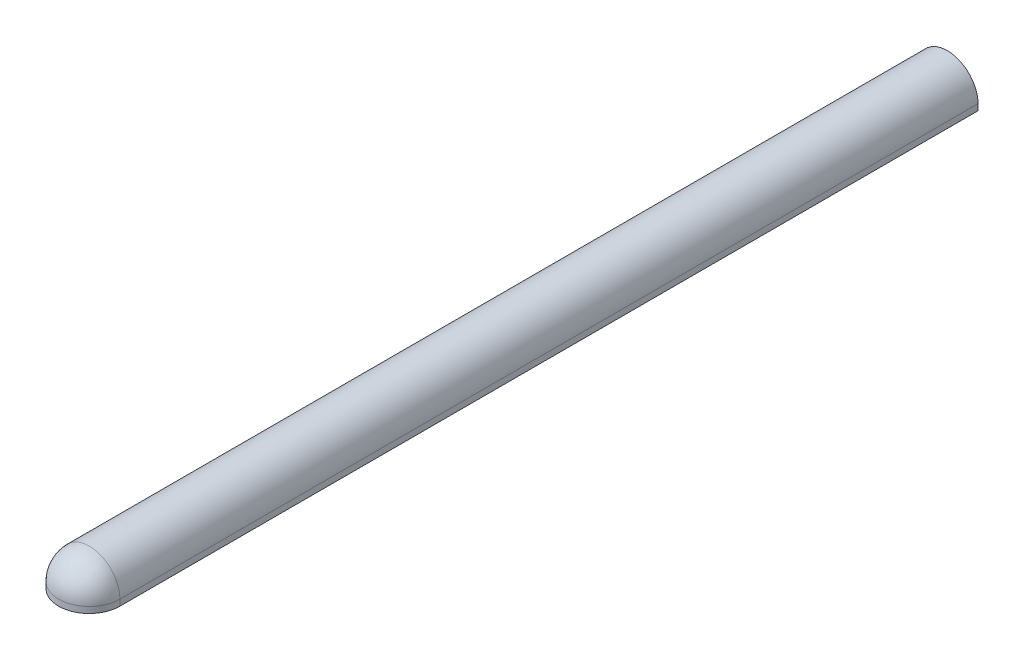
ISO-10303-21;
HEADER;
FILE_DESCRIPTION(('STEP AP214'),'2;1');
FILE_NAME('part.step','',(''),(''),'','','');
FILE_SCHEMA(('AUTOMOTIVE_DESIGN { 1 0 10303 214 1 1 1 1 }'));
ENDSEC;
DATA;
#1=APPLICATION_CONTEXT('core data for automotive mechanical design processes');
#2=APPLICATION_PROTOCOL_DEFINITION('international standard','automotive_design',2000,#1);
#3=PRODUCT_CONTEXT('',#1,'mechanical');
#4=PRODUCT('Part','Part','',(#3));
#5=PRODUCT_RELATED_PRODUCT_CATEGORY('part','',(#4));
#6=PRODUCT_DEFINITION_FORMATION('','',#4);
#7=PRODUCT_DEFINITION_CONTEXT('part definition',#1,'design');
#8=PRODUCT_DEFINITION('design','',#6,#7);
#9=PRODUCT_DEFINITION_SHAPE('','',#8);
#10=(LENGTH_UNIT() NAMED_UNIT(*) SI_UNIT(.MILLI.,.METRE.));
#11=(NAMED_UNIT(*) PLANE_ANGLE_UNIT() SI_UNIT($,.RADIAN.));
#12=(NAMED_UNIT(*) SI_UNIT($,.STERADIAN.) SOLID_ANGLE_UNIT());
#13=UNCERTAINTY_MEASURE_WITH_UNIT(LENGTH_MEASURE(1.E-05),#10,'distance_accuracy_value','');
#14=(GEOMETRIC_REPRESENTATION_CONTEXT(3) GLOBAL_UNCERTAINTY_ASSIGNED_CONTEXT((#13)) GLOBAL_UNIT_ASSIGNED_CONTEXT((#10,
#11,#12)) REPRESENTATION_CONTEXT('',''));
#15=CARTESIAN_POINT('',(0.,0.,0.));
#16=DIRECTION('',(0.,0.,1.));
#17=DIRECTION('',(1.,0.,0.));
#18=AXIS2_PLACEMENT_3D('',#15,#16,#17);
#19=CARTESIAN_POINT('',(0.,0.127000000000003,0.));
#20=DIRECTION('',(1.,0.,0.));
#21=DIRECTION('',(0.,-1.,0.));
#22=AXIS2_PLACEMENT_3D('',#19,#20,#21);
#23=SPHERICAL_SURFACE('',#22,0.4064);
#24=CARTESIAN_POINT('',(0.,0.127000000000003,0.));
#25=DIRECTION('',(0.,0.,-1.));
#26=DIRECTION('',(-1.,0.,0.));
#27=AXIS2_PLACEMENT_3D('',#24,#25,#26);
#28=CIRCLE('',#27,0.4064);
#29=CARTESIAN_POINT('',(-0.4064,0.127000000000003,0.));
#30=VERTEX_POINT('',#29);
#31=CARTESIAN_POINT('',(0.4064,0.127000000000003,0.));
#32=VERTEX_POINT('',#31);
#33=EDGE_CURVE('E103',#30,#32,#28,.T.);
#34=ORIENTED_EDGE('',*,*,#33,.T.);
#35=CARTESIAN_POINT('',(0.,0.127000000000003,0.));
#36=DIRECTION('',(0.,1.,0.));
#37=DIRECTION('',(0.,0.,1.));
#38=AXIS2_PLACEMENT_3D('',#35,#36,#37);
#39=CIRCLE('',#38,0.4064);
#40=EDGE_CURVE('E102',#32,#30,#39,.F.);
#41=ORIENTED_EDGE('',*,*,#40,.T.);
#42=EDGE_LOOP('',(#34,#41));
#43=FACE_BOUND('',#42,.T.);
#44=ADVANCED_FACE('F17',(#43),#23,.F.);
#45=CARTESIAN_POINT('',(0.,0.127000000000003,0.));
#46=DIRECTION('',(0.,0.,-1.));
#47=DIRECTION('',(-1.,0.,0.));
#48=AXIS2_PLACEMENT_3D('',#45,#46,#47);
#49=CYLINDRICAL_SURFACE('',#48,0.4064);
#50=DIRECTION('',(0.,0.,1.));
#51=VECTOR('',#50,1.);
#52=CARTESIAN_POINT('',(0.4064,0.127000000000003,0.));
#53=LINE('',#52,#51);
#54=CARTESIAN_POINT('',(0.4064,0.127000000000003,-17.78));
#55=VERTEX_POINT('',#54);
#56=EDGE_CURVE('E97',#32,#55,#53,.F.);
#57=ORIENTED_EDGE('',*,*,#56,.F.);
#58=ORIENTED_EDGE('',*,*,#33,.F.);
#59=DIRECTION('',(0.,0.,-1.));
#60=VECTOR('',#59,1.);
#61=CARTESIAN_POINT('',(-0.4064,0.127000000000003,0.));
#62=LINE('',#61,#60);
#63=CARTESIAN_POINT('',(-0.4064,0.127000000000003,-17.78));
#64=VERTEX_POINT('',#63);
#65=EDGE_CURVE('E100',#64,#30,#62,.F.);
#66=ORIENTED_EDGE('',*,*,#65,.F.);
#67=CARTESIAN_POINT('',(0.,0.127000000000003,-17.78));
#68=DIRECTION('',(0.,0.,-1.));
#69=DIRECTION('',(-1.,0.,0.));
#70=AXIS2_PLACEMENT_3D('',#67,#68,#69);
#71=CIRCLE('',#70,0.4064);
#72=EDGE_CURVE('E21',#55,#64,#71,.F.);
#73=ORIENTED_EDGE('',*,*,#72,.F.);
#74=EDGE_LOOP('',(#57,#58,#66,#73));
#75=FACE_BOUND('',#74,.T.);
#76=ADVANCED_FACE('F95',(#75),#49,.F.);
#77=CARTESIAN_POINT('',(0.,0.800100000000003,0.));
#78=DIRECTION('',(0.,1.,0.));
#79=DIRECTION('',(0.,0.,1.));
#80=AXIS2_PLACEMENT_3D('',#77,#78,#79);
#81=CYLINDRICAL_SURFACE('',#80,0.4064);
#82=CARTESIAN_POINT('',(0.,0.,0.));
#83=DIRECTION('',(0.,1.,0.));
#84=DIRECTION('',(0.,0.,1.));
#85=AXIS2_PLACEMENT_3D('',#82,#83,#84);
#86=CIRCLE('',#85,0.4064);
#87=CARTESIAN_POINT('',(0.4064,0.,0.));
#88=VERTEX_POINT('',#87);
#89=CARTESIAN_POINT('',(-0.4064,0.,0.));
#90=VERTEX_POINT('',#89);
#91=EDGE_CURVE('E106',#88,#90,#86,.F.);
#92=ORIENTED_EDGE('',*,*,#91,.T.);
#93=DIRECTION('',(0.,1.,0.));
#94=VECTOR('',#93,1.);
#95=CARTESIAN_POINT('',(-0.4064,0.127000000000003,0.));
#96=LINE('',#95,#94);
#97=EDGE_CURVE('E91',#30,#90,#96,.F.);
#98=ORIENTED_EDGE('',*,*,#97,.F.);
#99=ORIENTED_EDGE('',*,*,#40,.F.);
#100=DIRECTION('',(0.,1.,0.));
#101=VECTOR('',#100,1.);
#102=CARTESIAN_POINT('',(0.4064,0.127000000000003,0.));
#103=LINE('',#102,#101);
#104=EDGE_CURVE('E90',#88,#32,#103,.T.);
#105=ORIENTED_EDGE('',*,*,#104,.F.);
#106=EDGE_LOOP('',(#92,#98,#99,#105));
#107=FACE_BOUND('',#106,.T.);
#108=ADVANCED_FACE('F292',(#107),#81,.F.);
#109=CARTESIAN_POINT('',(-0.4064,0.127000000000003,0.));
#110=DIRECTION('',(1.,0.,0.));
#111=DIRECTION('',(0.,0.,-1.));
#112=AXIS2_PLACEMENT_3D('',#109,#110,#111);
#113=PLANE('',#112);
#114=ORIENTED_EDGE('',*,*,#97,.T.);
#115=DIRECTION('',(0.,0.,1.));
#116=VECTOR('',#115,1.);
#117=CARTESIAN_POINT('',(-0.4064,0.,0.));
#118=LINE('',#117,#116);
#119=CARTESIAN_POINT('',(-0.4064,0.,-17.78));
#120=VERTEX_POINT('',#119);
#121=EDGE_CURVE('E108',#90,#120,#118,.F.);
#122=ORIENTED_EDGE('',*,*,#121,.T.);
#123=DIRECTION('',(0.,1.,0.));
#124=VECTOR('',#123,1.);
#125=CARTESIAN_POINT('',(-0.4064,0.127000000000003,-17.78));
#126=LINE('',#125,#124);
#127=EDGE_CURVE('E121',#120,#64,#126,.T.);
#128=ORIENTED_EDGE('',*,*,#127,.T.);
#129=ORIENTED_EDGE('',*,*,#65,.T.);
#130=EDGE_LOOP('',(#114,#122,#128,#129));
#131=FACE_BOUND('',#130,.T.);
#132=ADVANCED_FACE('F179',(#131),#113,.T.);
#133=CARTESIAN_POINT('',(0.4064,0.127000000000003,0.));
#134=DIRECTION('',(-1.,0.,0.));
#135=DIRECTION('',(0.,0.,1.));
#136=AXIS2_PLACEMENT_3D('',#133,#134,#135);
#137=PLANE('',#136);
#138=ORIENTED_EDGE('',*,*,#104,.T.);
#139=ORIENTED_EDGE('',*,*,#56,.T.);
#140=DIRECTION('',(0.,1.,0.));
#141=VECTOR('',#140,1.);
#142=CARTESIAN_POINT('',(0.4064,0.127000000000003,-17.78));
#143=LINE('',#142,#141);
#144=CARTESIAN_POINT('',(0.4064,0.,-17.78));
#145=VERTEX_POINT('',#144);
#146=EDGE_CURVE('E80',#55,#145,#143,.F.);
#147=ORIENTED_EDGE('',*,*,#146,.T.);
#148=DIRECTION('',(0.,0.,1.));
#149=VECTOR('',#148,1.);
#150=CARTESIAN_POINT('',(0.4064,0.,0.));
#151=LINE('',#150,#149);
#152=EDGE_CURVE('E135',#145,#88,#151,.T.);
#153=ORIENTED_EDGE('',*,*,#152,.T.);
#154=EDGE_LOOP('',(#138,#139,#147,#153));
#155=FACE_BOUND('',#154,.T.);
#156=ADVANCED_FACE('F104',(#155),#137,.T.);
#157=CARTESIAN_POINT('',(0.635,0.,0.));
#158=DIRECTION('',(0.,1.,0.));
#159=DIRECTION('',(0.,0.,1.));
#160=AXIS2_PLACEMENT_3D('',#157,#158,#159);
#161=PLANE('',#160);
#162=DIRECTION('',(1.,0.,0.));
#163=VECTOR('',#162,1.);
#164=CARTESIAN_POINT('',(-0.635,0.,-17.78));
#165=LINE('',#164,#163);
#166=CARTESIAN_POINT('',(0.635,0.,-17.78));
#167=VERTEX_POINT('',#166);
#168=EDGE_CURVE('E85',#145,#167,#165,.T.);
#169=ORIENTED_EDGE('',*,*,#168,.T.);
#170=DIRECTION('',(0.,0.,1.));
#171=VECTOR('',#170,1.);
#172=CARTESIAN_POINT('',(0.635,0.,0.));
#173=LINE('',#172,#171);
#174=CARTESIAN_POINT('',(0.635,0.,0.));
#175=VERTEX_POINT('',#174);
#176=EDGE_CURVE('E150',#167,#175,#173,.T.);
#177=ORIENTED_EDGE('',*,*,#176,.T.);
#178=CARTESIAN_POINT('',(0.,0.,0.));
#179=DIRECTION('',(0.,1.,0.));
#180=DIRECTION('',(0.,0.,1.));
#181=AXIS2_PLACEMENT_3D('',#178,#179,#180);
#182=CIRCLE('',#181,0.635);
#183=CARTESIAN_POINT('',(-0.635,0.,0.));
#184=VERTEX_POINT('',#183);
#185=EDGE_CURVE('E133',#184,#175,#182,.T.);
#186=ORIENTED_EDGE('',*,*,#185,.F.);
#187=DIRECTION('',(0.,0.,-1.));
#188=VECTOR('',#187,1.);
#189=CARTESIAN_POINT('',(-0.635,0.,0.));
#190=LINE('',#189,#188);
#191=CARTESIAN_POINT('',(-0.635,0.,-17.78));
#192=VERTEX_POINT('',#191);
#193=EDGE_CURVE('E154',#184,#192,#190,.T.);
#194=ORIENTED_EDGE('',*,*,#193,.T.);
#195=DIRECTION('',(1.,0.,0.));
#196=VECTOR('',#195,1.);
#197=CARTESIAN_POINT('',(-0.635,0.,-17.78));
#198=LINE('',#197,#196);
#199=EDGE_CURVE('E134',#192,#120,#198,.T.);
#200=ORIENTED_EDGE('',*,*,#199,.T.);
#201=ORIENTED_EDGE('',*,*,#121,.F.);
#202=ORIENTED_EDGE('',*,*,#91,.F.);
#203=ORIENTED_EDGE('',*,*,#152,.F.);
#204=EDGE_LOOP('',(#169,#177,#186,#194,#200,#201,#202,#203));
#205=FACE_BOUND('',#204,.T.);
#206=ADVANCED_FACE('F200',(#205),#161,.F.);
#207=CARTESIAN_POINT('',(0.,0.800100000000003,0.));
#208=DIRECTION('',(0.,1.,0.));
#209=DIRECTION('',(0.,0.,1.));
#210=AXIS2_PLACEMENT_3D('',#207,#208,#209);
#211=CYLINDRICAL_SURFACE('',#210,0.635);
#212=DIRECTION('',(0.,1.,0.));
#213=VECTOR('',#212,1.);
#214=CARTESIAN_POINT('',(0.635,0.127000000000003,0.));
#215=LINE('',#214,#213);
#216=CARTESIAN_POINT('',(0.635,0.127000000000003,0.));
#217=VERTEX_POINT('',#216);
#218=EDGE_CURVE('E36',#175,#217,#215,.T.);
#219=ORIENTED_EDGE('',*,*,#218,.T.);
#220=CARTESIAN_POINT('',(0.,0.127000000000003,0.));
#221=DIRECTION('',(0.,-1.,0.));
#222=DIRECTION('',(1.,0.,0.));
#223=AXIS2_PLACEMENT_3D('',#220,#221,#222);
#224=CIRCLE('',#223,0.635);
#225=CARTESIAN_POINT('',(-0.635,0.127000000000003,0.));
#226=VERTEX_POINT('',#225);
#227=EDGE_CURVE('E167',#226,#217,#224,.F.);
#228=ORIENTED_EDGE('',*,*,#227,.F.);
#229=DIRECTION('',(0.,1.,0.));
#230=VECTOR('',#229,1.);
#231=CARTESIAN_POINT('',(-0.635,0.127000000000003,0.));
#232=LINE('',#231,#230);
#233=EDGE_CURVE('E157',#226,#184,#232,.F.);
#234=ORIENTED_EDGE('',*,*,#233,.T.);
#235=ORIENTED_EDGE('',*,*,#185,.T.);
#236=EDGE_LOOP('',(#219,#228,#234,#235));
#237=FACE_BOUND('',#236,.T.);
#238=ADVANCED_FACE('F210',(#237),#211,.T.);
#239=CARTESIAN_POINT('',(-0.635,0.127000000000003,-17.78));
#240=DIRECTION('',(0.,0.,1.));
#241=DIRECTION('',(1.,0.,0.));
#242=AXIS2_PLACEMENT_3D('',#239,#240,#241);
#243=PLANE('',#242);
#244=CARTESIAN_POINT('',(0.,0.127000000000003,-17.78));
#245=DIRECTION('',(0.,0.,-1.));
#246=DIRECTION('',(-1.,0.,0.));
#247=AXIS2_PLACEMENT_3D('',#244,#245,#246);
#248=CIRCLE('',#247,0.635);
#249=CARTESIAN_POINT('',(0.635,0.127000000000003,-17.78));
#250=VERTEX_POINT('',#249);
#251=CARTESIAN_POINT('',(-0.635,0.127000000000003,-17.78));
#252=VERTEX_POINT('',#251);
#253=EDGE_CURVE('E128',#250,#252,#248,.F.);
#254=ORIENTED_EDGE('',*,*,#253,.F.);
#255=DIRECTION('',(0.,1.,0.));
#256=VECTOR('',#255,1.);
#257=CARTESIAN_POINT('',(0.635,0.127000000000003,-17.78));
#258=LINE('',#257,#256);
#259=EDGE_CURVE('E132',#250,#167,#258,.F.);
#260=ORIENTED_EDGE('',*,*,#259,.T.);
#261=ORIENTED_EDGE('',*,*,#168,.F.);
#262=ORIENTED_EDGE('',*,*,#146,.F.);
#263=ORIENTED_EDGE('',*,*,#72,.T.);
#264=ORIENTED_EDGE('',*,*,#127,.F.);
#265=ORIENTED_EDGE('',*,*,#199,.F.);
#266=DIRECTION('',(0.,1.,0.));
#267=VECTOR('',#266,1.);
#268=CARTESIAN_POINT('',(-0.635,0.127000000000003,-17.78));
#269=LINE('',#268,#267);
#270=EDGE_CURVE('E156',#192,#252,#269,.T.);
#271=ORIENTED_EDGE('',*,*,#270,.T.);
#272=EDGE_LOOP('',(#254,#260,#261,#262,#263,#264,#265,#271));
#273=FACE_BOUND('',#272,.T.);
#274=ADVANCED_FACE('F82',(#273),#243,.F.);
#275=CARTESIAN_POINT('',(-0.635,0.127000000000003,0.));
#276=DIRECTION('',(1.,0.,0.));
#277=DIRECTION('',(0.,0.,-1.));
#278=AXIS2_PLACEMENT_3D('',#275,#276,#277);
#279=PLANE('',#278);
#280=ORIENTED_EDGE('',*,*,#193,.F.);
#281=ORIENTED_EDGE('',*,*,#233,.F.);
#282=DIRECTION('',(0.,0.,-1.));
#283=VECTOR('',#282,1.);
#284=CARTESIAN_POINT('',(-0.635,0.127000000000003,0.));
#285=LINE('',#284,#283);
#286=EDGE_CURVE('E131',#252,#226,#285,.F.);
#287=ORIENTED_EDGE('',*,*,#286,.F.);
#288=ORIENTED_EDGE('',*,*,#270,.F.);
#289=EDGE_LOOP('',(#280,#281,#287,#288));
#290=FACE_BOUND('',#289,.T.);
#291=ADVANCED_FACE('F187',(#290),#279,.F.);
#292=CARTESIAN_POINT('',(0.,0.127000000000003,0.));
#293=DIRECTION('',(1.,0.,0.));
#294=DIRECTION('',(0.,-1.,0.));
#295=AXIS2_PLACEMENT_3D('',#292,#293,#294);
#296=SPHERICAL_SURFACE('',#295,0.635);
#297=ORIENTED_EDGE('',*,*,#227,.T.);
#298=CARTESIAN_POINT('',(0.,0.127000000000003,0.));
#299=DIRECTION('',(0.,0.,-1.));
#300=DIRECTION('',(-1.,0.,0.));
#301=AXIS2_PLACEMENT_3D('',#298,#299,#300);
#302=CIRCLE('',#301,0.635);
#303=EDGE_CURVE('E27',#226,#217,#302,.T.);
#304=ORIENTED_EDGE('',*,*,#303,.F.);
#305=EDGE_LOOP('',(#297,#304));
#306=FACE_BOUND('',#305,.T.);
#307=ADVANCED_FACE('F209',(#306),#296,.T.);
#308=CARTESIAN_POINT('',(0.635,0.127000000000003,0.));
#309=DIRECTION('',(-1.,0.,0.));
#310=DIRECTION('',(0.,0.,1.));
#311=AXIS2_PLACEMENT_3D('',#308,#309,#310);
#312=PLANE('',#311);
#313=DIRECTION('',(0.,0.,-1.));
#314=VECTOR('',#313,1.);
#315=CARTESIAN_POINT('',(0.635,0.127000000000003,0.));
#316=LINE('',#315,#314);
#317=EDGE_CURVE('E11',#217,#250,#316,.T.);
#318=ORIENTED_EDGE('',*,*,#317,.F.);
#319=ORIENTED_EDGE('',*,*,#218,.F.);
#320=ORIENTED_EDGE('',*,*,#176,.F.);
#321=ORIENTED_EDGE('',*,*,#259,.F.);
#322=EDGE_LOOP('',(#318,#319,#320,#321));
#323=FACE_BOUND('',#322,.T.);
#324=ADVANCED_FACE('F204',(#323),#312,.F.);
#325=CARTESIAN_POINT('',(0.,0.127000000000003,0.));
#326=DIRECTION('',(0.,0.,-1.));
#327=DIRECTION('',(-1.,0.,0.));
#328=AXIS2_PLACEMENT_3D('',#325,#326,#327);
#329=CYLINDRICAL_SURFACE('',#328,0.635);
#330=ORIENTED_EDGE('',*,*,#303,.T.);
#331=ORIENTED_EDGE('',*,*,#317,.T.);
#332=ORIENTED_EDGE('',*,*,#253,.T.);
#333=ORIENTED_EDGE('',*,*,#286,.T.);
#334=EDGE_LOOP('',(#330,#331,#332,#333));
#335=FACE_BOUND('',#334,.T.);
#336=ADVANCED_FACE('F207',(#335),#329,.T.);
#337=CLOSED_SHELL('',(#44,#76,#108,#132,#156,#206,#238,#274,#291,#307,#324,#336));
#338=MANIFOLD_SOLID_BREP('B1',#337);
#339=ADVANCED_BREP_SHAPE_REPRESENTATION('',(#18,#338),#14);
#340=SHAPE_DEFINITION_REPRESENTATION(#9,#339);
ENDSEC;
END-ISO-10303-21;
